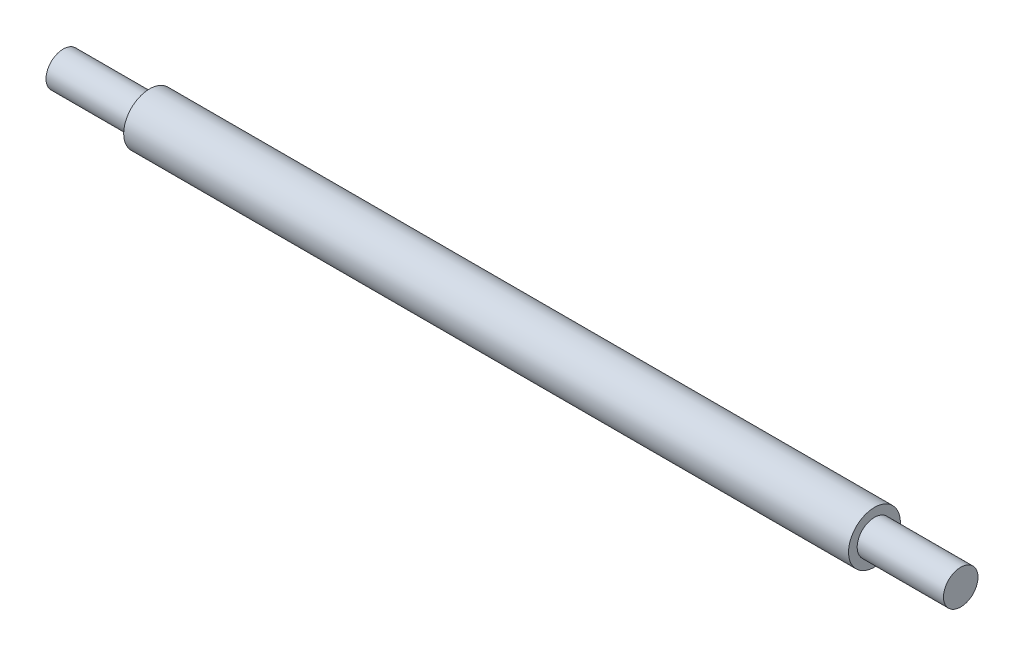
ISO-10303-21;
HEADER;
FILE_DESCRIPTION(('STEP AP214'),'2;1');
FILE_NAME('part.step','',(''),(''),'','','');
FILE_SCHEMA(('AUTOMOTIVE_DESIGN { 1 0 10303 214 1 1 1 1 }'));
ENDSEC;
DATA;
#1=APPLICATION_CONTEXT('core data for automotive mechanical design processes');
#2=APPLICATION_PROTOCOL_DEFINITION('international standard','automotive_design',2000,#1);
#3=PRODUCT_CONTEXT('',#1,'mechanical');
#4=PRODUCT('Part','Part','',(#3));
#5=PRODUCT_RELATED_PRODUCT_CATEGORY('part','',(#4));
#6=PRODUCT_DEFINITION_FORMATION('','',#4);
#7=PRODUCT_DEFINITION_CONTEXT('part definition',#1,'design');
#8=PRODUCT_DEFINITION('design','',#6,#7);
#9=PRODUCT_DEFINITION_SHAPE('','',#8);
#10=(LENGTH_UNIT() NAMED_UNIT(*) SI_UNIT(.MILLI.,.METRE.));
#11=(NAMED_UNIT(*) PLANE_ANGLE_UNIT() SI_UNIT($,.RADIAN.));
#12=(NAMED_UNIT(*) SI_UNIT($,.STERADIAN.) SOLID_ANGLE_UNIT());
#13=UNCERTAINTY_MEASURE_WITH_UNIT(LENGTH_MEASURE(1.E-05),#10,'distance_accuracy_value','');
#14=(GEOMETRIC_REPRESENTATION_CONTEXT(3) GLOBAL_UNCERTAINTY_ASSIGNED_CONTEXT((#13)) GLOBAL_UNIT_ASSIGNED_CONTEXT((#10,
#11,#12)) REPRESENTATION_CONTEXT('',''));
#15=CARTESIAN_POINT('',(0.,0.,0.));
#16=DIRECTION('',(0.,0.,1.));
#17=DIRECTION('',(1.,0.,0.));
#18=AXIS2_PLACEMENT_3D('',#15,#16,#17);
#19=CARTESIAN_POINT('',(-10.,0.,0.));
#20=DIRECTION('',(1.,0.,0.));
#21=DIRECTION('',(0.,0.,-1.));
#22=AXIS2_PLACEMENT_3D('',#19,#20,#21);
#23=CYLINDRICAL_SURFACE('',#22,2.);
#24=CARTESIAN_POINT('',(-10.,0.,0.));
#25=DIRECTION('',(1.,0.,0.));
#26=DIRECTION('',(0.,0.,-1.));
#27=AXIS2_PLACEMENT_3D('',#24,#25,#26);
#28=CIRCLE('',#27,2.);
#29=CARTESIAN_POINT('',(-10.,0.,-2.));
#30=VERTEX_POINT('',#29);
#31=EDGE_CURVE('E45',#30,#30,#28,.T.);
#32=ORIENTED_EDGE('',*,*,#31,.T.);
#33=EDGE_LOOP('',(#32));
#34=FACE_BOUND('',#33,.T.);
#35=CARTESIAN_POINT('',(0.,0.,0.));
#36=DIRECTION('',(1.,0.,0.));
#37=DIRECTION('',(0.,0.,-1.));
#38=AXIS2_PLACEMENT_3D('',#35,#36,#37);
#39=CIRCLE('',#38,2.);
#40=CARTESIAN_POINT('',(0.,0.,-2.));
#41=VERTEX_POINT('',#40);
#42=EDGE_CURVE('E37',#41,#41,#39,.T.);
#43=ORIENTED_EDGE('',*,*,#42,.F.);
#44=EDGE_LOOP('',(#43));
#45=FACE_BOUND('',#44,.T.);
#46=ADVANCED_FACE('F34',(#34,#45),#23,.T.);
#47=CARTESIAN_POINT('',(0.,0.,0.));
#48=DIRECTION('',(1.,0.,0.));
#49=DIRECTION('',(0.,0.,-1.));
#50=AXIS2_PLACEMENT_3D('',#47,#48,#49);
#51=PLANE('',#50);
#52=ORIENTED_EDGE('',*,*,#42,.T.);
#53=EDGE_LOOP('',(#52));
#54=FACE_BOUND('',#53,.T.);
#55=ADVANCED_FACE('F69',(#54),#51,.T.);
#56=CARTESIAN_POINT('',(-94.,0.,0.));
#57=DIRECTION('',(1.,0.,0.));
#58=DIRECTION('',(0.,0.,-1.));
#59=AXIS2_PLACEMENT_3D('',#56,#57,#58);
#60=CYLINDRICAL_SURFACE('',#59,3.);
#61=CARTESIAN_POINT('',(-94.,0.,0.));
#62=DIRECTION('',(-1.,0.,0.));
#63=DIRECTION('',(0.,0.,1.));
#64=AXIS2_PLACEMENT_3D('',#61,#62,#63);
#65=CIRCLE('',#64,3.);
#66=CARTESIAN_POINT('',(-94.,0.,3.));
#67=VERTEX_POINT('',#66);
#68=EDGE_CURVE('E49',#67,#67,#65,.T.);
#69=ORIENTED_EDGE('',*,*,#68,.F.);
#70=EDGE_LOOP('',(#69));
#71=FACE_BOUND('',#70,.T.);
#72=CARTESIAN_POINT('',(-10.,0.,0.));
#73=DIRECTION('',(-1.,0.,0.));
#74=DIRECTION('',(0.,0.,1.));
#75=AXIS2_PLACEMENT_3D('',#72,#73,#74);
#76=CIRCLE('',#75,3.);
#77=CARTESIAN_POINT('',(-10.,0.,3.));
#78=VERTEX_POINT('',#77);
#79=EDGE_CURVE('E52',#78,#78,#76,.T.);
#80=ORIENTED_EDGE('',*,*,#79,.T.);
#81=EDGE_LOOP('',(#80));
#82=FACE_BOUND('',#81,.T.);
#83=ADVANCED_FACE('F67',(#71,#82),#60,.T.);
#84=CARTESIAN_POINT('',(-94.,0.,0.));
#85=DIRECTION('',(-1.,0.,0.));
#86=DIRECTION('',(0.,0.,1.));
#87=AXIS2_PLACEMENT_3D('',#84,#85,#86);
#88=PLANE('',#87);
#89=CARTESIAN_POINT('',(-94.,0.,0.));
#90=DIRECTION('',(-1.,0.,0.));
#91=DIRECTION('',(0.,0.,1.));
#92=AXIS2_PLACEMENT_3D('',#89,#90,#91);
#93=CIRCLE('',#92,2.);
#94=CARTESIAN_POINT('',(-94.,0.,2.));
#95=VERTEX_POINT('',#94);
#96=EDGE_CURVE('E10',#95,#95,#93,.T.);
#97=ORIENTED_EDGE('',*,*,#96,.F.);
#98=EDGE_LOOP('',(#97));
#99=FACE_BOUND('',#98,.T.);
#100=ORIENTED_EDGE('',*,*,#68,.T.);
#101=EDGE_LOOP('',(#100));
#102=FACE_BOUND('',#101,.T.);
#103=ADVANCED_FACE('F63',(#99,#102),#88,.T.);
#104=CARTESIAN_POINT('',(-10.,0.,0.));
#105=DIRECTION('',(-1.,0.,0.));
#106=DIRECTION('',(0.,0.,1.));
#107=AXIS2_PLACEMENT_3D('',#104,#105,#106);
#108=PLANE('',#107);
#109=ORIENTED_EDGE('',*,*,#31,.F.);
#110=EDGE_LOOP('',(#109));
#111=FACE_BOUND('',#110,.T.);
#112=ORIENTED_EDGE('',*,*,#79,.F.);
#113=EDGE_LOOP('',(#112));
#114=FACE_BOUND('',#113,.T.);
#115=ADVANCED_FACE('F59',(#111,#114),#108,.F.);
#116=CARTESIAN_POINT('',(-104.,0.,0.));
#117=DIRECTION('',(1.,0.,0.));
#118=DIRECTION('',(0.,0.,-1.));
#119=AXIS2_PLACEMENT_3D('',#116,#117,#118);
#120=CYLINDRICAL_SURFACE('',#119,2.);
#121=CARTESIAN_POINT('',(-104.,0.,0.));
#122=DIRECTION('',(-1.,0.,0.));
#123=DIRECTION('',(0.,0.,1.));
#124=AXIS2_PLACEMENT_3D('',#121,#122,#123);
#125=CIRCLE('',#124,2.);
#126=CARTESIAN_POINT('',(-104.,0.,2.));
#127=VERTEX_POINT('',#126);
#128=EDGE_CURVE('E48',#127,#127,#125,.T.);
#129=ORIENTED_EDGE('',*,*,#128,.F.);
#130=EDGE_LOOP('',(#129));
#131=FACE_BOUND('',#130,.T.);
#132=ORIENTED_EDGE('',*,*,#96,.T.);
#133=EDGE_LOOP('',(#132));
#134=FACE_BOUND('',#133,.T.);
#135=ADVANCED_FACE('F62',(#131,#134),#120,.T.);
#136=CARTESIAN_POINT('',(-104.,0.,0.));
#137=DIRECTION('',(-1.,0.,0.));
#138=DIRECTION('',(0.,0.,1.));
#139=AXIS2_PLACEMENT_3D('',#136,#137,#138);
#140=PLANE('',#139);
#141=ORIENTED_EDGE('',*,*,#128,.T.);
#142=EDGE_LOOP('',(#141));
#143=FACE_BOUND('',#142,.T.);
#144=ADVANCED_FACE('F112',(#143),#140,.T.);
#145=CLOSED_SHELL('',(#46,#55,#83,#103,#115,#135,#144));
#146=MANIFOLD_SOLID_BREP('B2',#145);
#147=ADVANCED_BREP_SHAPE_REPRESENTATION('',(#18,#146),#14);
#148=SHAPE_DEFINITION_REPRESENTATION(#9,#147);
ENDSEC;
END-ISO-10303-21;
